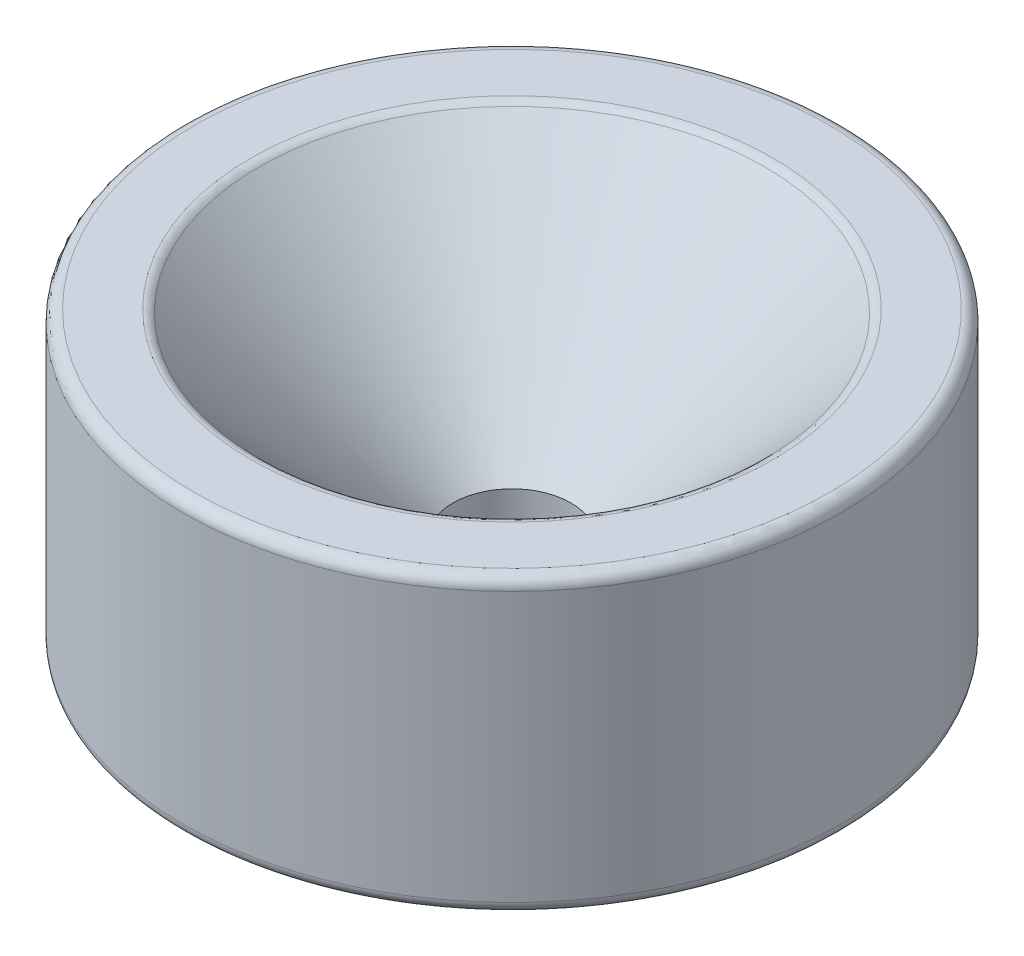
ISO-10303-21;
HEADER;
FILE_DESCRIPTION(('STEP AP214'),'2;1');
FILE_NAME('part.step','',(''),(''),'','','');
FILE_SCHEMA(('AUTOMOTIVE_DESIGN { 1 0 10303 214 1 1 1 1 }'));
ENDSEC;
DATA;
#1=APPLICATION_CONTEXT('core data for automotive mechanical design processes');
#2=APPLICATION_PROTOCOL_DEFINITION('international standard','automotive_design',2000,#1);
#3=PRODUCT_CONTEXT('',#1,'mechanical');
#4=PRODUCT('Part','Part','',(#3));
#5=PRODUCT_RELATED_PRODUCT_CATEGORY('part','',(#4));
#6=PRODUCT_DEFINITION_FORMATION('','',#4);
#7=PRODUCT_DEFINITION_CONTEXT('part definition',#1,'design');
#8=PRODUCT_DEFINITION('design','',#6,#7);
#9=PRODUCT_DEFINITION_SHAPE('','',#8);
#10=(LENGTH_UNIT() NAMED_UNIT(*) SI_UNIT(.MILLI.,.METRE.));
#11=(NAMED_UNIT(*) PLANE_ANGLE_UNIT() SI_UNIT($,.RADIAN.));
#12=(NAMED_UNIT(*) SI_UNIT($,.STERADIAN.) SOLID_ANGLE_UNIT());
#13=UNCERTAINTY_MEASURE_WITH_UNIT(LENGTH_MEASURE(1.E-05),#10,'distance_accuracy_value','');
#14=(GEOMETRIC_REPRESENTATION_CONTEXT(3) GLOBAL_UNCERTAINTY_ASSIGNED_CONTEXT((#13)) GLOBAL_UNIT_ASSIGNED_CONTEXT((#10,
#11,#12)) REPRESENTATION_CONTEXT('',''));
#15=CARTESIAN_POINT('',(0.,0.,0.));
#16=DIRECTION('',(0.,0.,1.));
#17=DIRECTION('',(1.,0.,0.));
#18=AXIS2_PLACEMENT_3D('',#15,#16,#17);
#19=CARTESIAN_POINT('',(0.,0.762,0.));
#20=DIRECTION('',(0.,-1.,0.));
#21=DIRECTION('',(0.,0.,-1.));
#22=AXIS2_PLACEMENT_3D('',#19,#20,#21);
#23=CONICAL_SURFACE('',#22,8.763,0.785398163397448);
#24=CARTESIAN_POINT('',(0.,0.,0.));
#25=DIRECTION('',(0.,-1.,0.));
#26=DIRECTION('',(0.,0.,-1.));
#27=AXIS2_PLACEMENT_3D('',#24,#25,#26);
#28=CIRCLE('',#27,9.525);
#29=CARTESIAN_POINT('',(0.,0.,-9.525));
#30=VERTEX_POINT('',#29);
#31=EDGE_CURVE('E76',#30,#30,#28,.T.);
#32=ORIENTED_EDGE('',*,*,#31,.T.);
#33=EDGE_LOOP('',(#32));
#34=FACE_BOUND('',#33,.T.);
#35=CARTESIAN_POINT('',(0.,0.762,0.));
#36=DIRECTION('',(0.,-1.,0.));
#37=DIRECTION('',(0.,0.,-1.));
#38=AXIS2_PLACEMENT_3D('',#35,#36,#37);
#39=CIRCLE('',#38,8.763);
#40=CARTESIAN_POINT('',(0.,0.762,-8.763));
#41=VERTEX_POINT('',#40);
#42=EDGE_CURVE('E73',#41,#41,#39,.T.);
#43=ORIENTED_EDGE('',*,*,#42,.F.);
#44=EDGE_LOOP('',(#43));
#45=FACE_BOUND('',#44,.T.);
#46=ADVANCED_FACE('F47',(#34,#45),#23,.F.);
#47=CARTESIAN_POINT('',(0.,0.762,0.));
#48=DIRECTION('',(0.,-1.,0.));
#49=DIRECTION('',(0.,0.,-1.));
#50=AXIS2_PLACEMENT_3D('',#47,#48,#49);
#51=PLANE('',#50);
#52=CARTESIAN_POINT('',(0.,0.761999999999999,0.));
#53=DIRECTION('',(0.,-1.,0.));
#54=DIRECTION('',(0.,0.,-1.));
#55=AXIS2_PLACEMENT_3D('',#52,#53,#54);
#56=CIRCLE('',#55,2.55269999999999);
#57=CARTESIAN_POINT('',(0.,0.761999999999999,-2.55269999999999));
#58=VERTEX_POINT('',#57);
#59=EDGE_CURVE('E82',#58,#58,#56,.T.);
#60=ORIENTED_EDGE('',*,*,#59,.F.);
#61=EDGE_LOOP('',(#60));
#62=FACE_BOUND('',#61,.T.);
#63=ORIENTED_EDGE('',*,*,#42,.T.);
#64=EDGE_LOOP('',(#63));
#65=FACE_BOUND('',#64,.T.);
#66=ADVANCED_FACE('F88',(#62,#65),#51,.T.);
#67=CARTESIAN_POINT('',(0.,12.7,0.));
#68=DIRECTION('',(0.,1.,0.));
#69=DIRECTION('',(0.,0.,1.));
#70=AXIS2_PLACEMENT_3D('',#67,#68,#69);
#71=CONICAL_SURFACE('',#70,11.1125,0.785398163397443);
#72=CARTESIAN_POINT('',(0.,4.1401999999999,0.));
#73=DIRECTION('',(0.,1.,0.));
#74=DIRECTION('',(0.,0.,1.));
#75=AXIS2_PLACEMENT_3D('',#72,#73,#74);
#76=CIRCLE('',#75,2.55269999999999);
#77=CARTESIAN_POINT('',(0.,4.1401999999999,2.55269999999999));
#78=VERTEX_POINT('',#77);
#79=EDGE_CURVE('E79',#78,#78,#76,.T.);
#80=ORIENTED_EDGE('',*,*,#79,.F.);
#81=EDGE_LOOP('',(#80));
#82=FACE_BOUND('',#81,.T.);
#83=CARTESIAN_POINT('',(0.,12.5512102448428,0.));
#84=DIRECTION('',(0.,-1.,0.));
#85=DIRECTION('',(0.,0.,-1.));
#86=AXIS2_PLACEMENT_3D('',#83,#84,#85);
#87=CIRCLE('',#86,10.9637102448428);
#88=CARTESIAN_POINT('',(0.,12.5512102448428,-10.9637102448428));
#89=VERTEX_POINT('',#88);
#90=EDGE_CURVE('E12',#89,#89,#87,.F.);
#91=ORIENTED_EDGE('',*,*,#90,.T.);
#92=EDGE_LOOP('',(#91));
#93=FACE_BOUND('',#92,.T.);
#94=ADVANCED_FACE('F91',(#82,#93),#71,.F.);
#95=CARTESIAN_POINT('',(14.2875,12.7,0.));
#96=DIRECTION('',(0.,1.,0.));
#97=DIRECTION('',(0.,0.,1.));
#98=AXIS2_PLACEMENT_3D('',#95,#96,#97);
#99=PLANE('',#98);
#100=CARTESIAN_POINT('',(0.,12.7,0.));
#101=DIRECTION('',(0.,1.,0.));
#102=DIRECTION('',(0.,0.,1.));
#103=AXIS2_PLACEMENT_3D('',#100,#101,#102);
#104=CIRCLE('',#103,13.7795);
#105=CARTESIAN_POINT('',(0.,12.7,13.7795));
#106=VERTEX_POINT('',#105);
#107=EDGE_CURVE('E54',#106,#106,#104,.T.);
#108=ORIENTED_EDGE('',*,*,#107,.T.);
#109=EDGE_LOOP('',(#108));
#110=FACE_BOUND('',#109,.T.);
#111=CARTESIAN_POINT('',(0.,12.7,0.));
#112=DIRECTION('',(0.,1.,0.));
#113=DIRECTION('',(0.,0.,1.));
#114=AXIS2_PLACEMENT_3D('',#111,#112,#113);
#115=CIRCLE('',#114,11.3229204896855);
#116=CARTESIAN_POINT('',(0.,12.7,11.3229204896855));
#117=VERTEX_POINT('',#116);
#118=EDGE_CURVE('E58',#117,#117,#115,.F.);
#119=ORIENTED_EDGE('',*,*,#118,.T.);
#120=EDGE_LOOP('',(#119));
#121=FACE_BOUND('',#120,.T.);
#122=ADVANCED_FACE('F118',(#110,#121),#99,.T.);
#123=CARTESIAN_POINT('',(0.,0.,0.));
#124=DIRECTION('',(0.,-1.,0.));
#125=DIRECTION('',(0.,0.,-1.));
#126=AXIS2_PLACEMENT_3D('',#123,#124,#125);
#127=CYLINDRICAL_SURFACE('',#126,14.2875);
#128=CARTESIAN_POINT('',(0.,0.508,0.));
#129=DIRECTION('',(0.,-1.,0.));
#130=DIRECTION('',(0.,0.,-1.));
#131=AXIS2_PLACEMENT_3D('',#128,#129,#130);
#132=CIRCLE('',#131,14.2875);
#133=CARTESIAN_POINT('',(0.,0.508,-14.2875));
#134=VERTEX_POINT('',#133);
#135=EDGE_CURVE('E62',#134,#134,#132,.F.);
#136=ORIENTED_EDGE('',*,*,#135,.T.);
#137=EDGE_LOOP('',(#136));
#138=FACE_BOUND('',#137,.T.);
#139=CARTESIAN_POINT('',(0.,12.192,0.));
#140=DIRECTION('',(0.,1.,0.));
#141=DIRECTION('',(0.,0.,1.));
#142=AXIS2_PLACEMENT_3D('',#139,#140,#141);
#143=CIRCLE('',#142,14.2875);
#144=CARTESIAN_POINT('',(0.,12.192,14.2875));
#145=VERTEX_POINT('',#144);
#146=EDGE_CURVE('E67',#145,#145,#143,.F.);
#147=ORIENTED_EDGE('',*,*,#146,.T.);
#148=EDGE_LOOP('',(#147));
#149=FACE_BOUND('',#148,.T.);
#150=ADVANCED_FACE('F116',(#138,#149),#127,.T.);
#151=CARTESIAN_POINT('',(9.525,0.,0.));
#152=DIRECTION('',(0.,-1.,0.));
#153=DIRECTION('',(0.,0.,-1.));
#154=AXIS2_PLACEMENT_3D('',#151,#152,#153);
#155=PLANE('',#154);
#156=CARTESIAN_POINT('',(0.,0.,0.));
#157=DIRECTION('',(0.,-1.,0.));
#158=DIRECTION('',(0.,0.,-1.));
#159=AXIS2_PLACEMENT_3D('',#156,#157,#158);
#160=CIRCLE('',#159,13.7795);
#161=CARTESIAN_POINT('',(0.,0.,-13.7795));
#162=VERTEX_POINT('',#161);
#163=EDGE_CURVE('E70',#162,#162,#160,.T.);
#164=ORIENTED_EDGE('',*,*,#163,.T.);
#165=EDGE_LOOP('',(#164));
#166=FACE_BOUND('',#165,.T.);
#167=ORIENTED_EDGE('',*,*,#31,.F.);
#168=EDGE_LOOP('',(#167));
#169=FACE_BOUND('',#168,.T.);
#170=ADVANCED_FACE('F105',(#166,#169),#155,.T.);
#171=CARTESIAN_POINT('',(0.,0.508,0.));
#172=DIRECTION('',(0.,-1.,0.));
#173=DIRECTION('',(0.,0.,-1.));
#174=AXIS2_PLACEMENT_3D('',#171,#172,#173);
#175=TOROIDAL_SURFACE('',#174,13.7795,0.508);
#176=ORIENTED_EDGE('',*,*,#135,.F.);
#177=EDGE_LOOP('',(#176));
#178=FACE_BOUND('',#177,.T.);
#179=ORIENTED_EDGE('',*,*,#163,.F.);
#180=EDGE_LOOP('',(#179));
#181=FACE_BOUND('',#180,.T.);
#182=ADVANCED_FACE('F102',(#178,#181),#175,.T.);
#183=CARTESIAN_POINT('',(0.,12.192,0.));
#184=DIRECTION('',(0.,1.,0.));
#185=DIRECTION('',(0.,0.,1.));
#186=AXIS2_PLACEMENT_3D('',#183,#184,#185);
#187=TOROIDAL_SURFACE('',#186,13.7795,0.508);
#188=ORIENTED_EDGE('',*,*,#107,.F.);
#189=EDGE_LOOP('',(#188));
#190=FACE_BOUND('',#189,.T.);
#191=ORIENTED_EDGE('',*,*,#146,.F.);
#192=EDGE_LOOP('',(#191));
#193=FACE_BOUND('',#192,.T.);
#194=ADVANCED_FACE('F104',(#190,#193),#187,.T.);
#195=CARTESIAN_POINT('',(0.,12.192,0.));
#196=DIRECTION('',(0.,1.,0.));
#197=DIRECTION('',(0.,0.,1.));
#198=AXIS2_PLACEMENT_3D('',#195,#196,#197);
#199=TOROIDAL_SURFACE('',#198,11.3229204896855,0.508);
#200=ORIENTED_EDGE('',*,*,#90,.F.);
#201=EDGE_LOOP('',(#200));
#202=FACE_BOUND('',#201,.T.);
#203=ORIENTED_EDGE('',*,*,#118,.F.);
#204=EDGE_LOOP('',(#203));
#205=FACE_BOUND('',#204,.T.);
#206=ADVANCED_FACE('F49',(#202,#205),#199,.T.);
#207=CARTESIAN_POINT('',(0.,0.762,0.));
#208=DIRECTION('',(0.,-1.,0.));
#209=DIRECTION('',(0.,0.,-1.));
#210=AXIS2_PLACEMENT_3D('',#207,#208,#209);
#211=CYLINDRICAL_SURFACE('',#210,2.55269999999999);
#212=ORIENTED_EDGE('',*,*,#79,.T.);
#213=EDGE_LOOP('',(#212));
#214=FACE_BOUND('',#213,.T.);
#215=ORIENTED_EDGE('',*,*,#59,.T.);
#216=EDGE_LOOP('',(#215));
#217=FACE_BOUND('',#216,.T.);
#218=ADVANCED_FACE('F86',(#214,#217),#211,.F.);
#219=CLOSED_SHELL('',(#46,#66,#94,#122,#150,#170,#182,#194,#206,#218));
#220=MANIFOLD_SOLID_BREP('B2',#219);
#221=ADVANCED_BREP_SHAPE_REPRESENTATION('',(#18,#220),#14);
#222=SHAPE_DEFINITION_REPRESENTATION(#9,#221);
ENDSEC;
END-ISO-10303-21;
